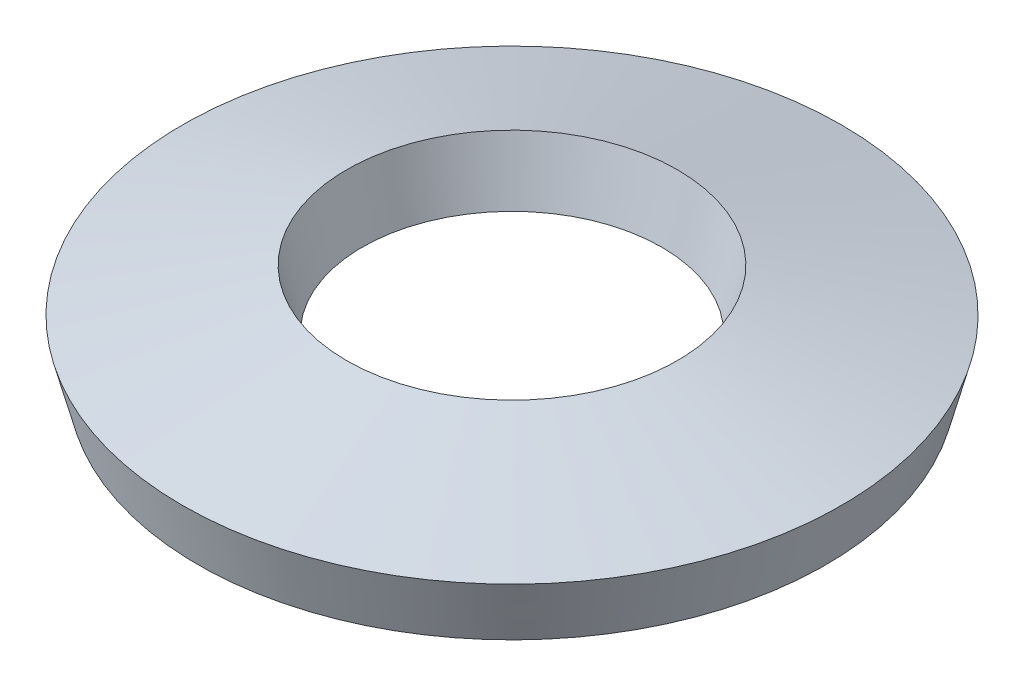
ISO-10303-21;
HEADER;
FILE_DESCRIPTION(('STEP AP214'),'2;1');
FILE_NAME('part.step','',(''),(''),'','','');
FILE_SCHEMA(('AUTOMOTIVE_DESIGN { 1 0 10303 214 1 1 1 1 }'));
ENDSEC;
DATA;
#1=APPLICATION_CONTEXT('core data for automotive mechanical design processes');
#2=APPLICATION_PROTOCOL_DEFINITION('international standard','automotive_design',2000,#1);
#3=PRODUCT_CONTEXT('',#1,'mechanical');
#4=PRODUCT('Part','Part','',(#3));
#5=PRODUCT_RELATED_PRODUCT_CATEGORY('part','',(#4));
#6=PRODUCT_DEFINITION_FORMATION('','',#4);
#7=PRODUCT_DEFINITION_CONTEXT('part definition',#1,'design');
#8=PRODUCT_DEFINITION('design','',#6,#7);
#9=PRODUCT_DEFINITION_SHAPE('','',#8);
#10=(LENGTH_UNIT() NAMED_UNIT(*) SI_UNIT(.MILLI.,.METRE.));
#11=(NAMED_UNIT(*) PLANE_ANGLE_UNIT() SI_UNIT($,.RADIAN.));
#12=(NAMED_UNIT(*) SI_UNIT($,.STERADIAN.) SOLID_ANGLE_UNIT());
#13=UNCERTAINTY_MEASURE_WITH_UNIT(LENGTH_MEASURE(1.E-05),#10,'distance_accuracy_value','');
#14=(GEOMETRIC_REPRESENTATION_CONTEXT(3) GLOBAL_UNCERTAINTY_ASSIGNED_CONTEXT((#13)) GLOBAL_UNIT_ASSIGNED_CONTEXT((#10,
#11,#12)) REPRESENTATION_CONTEXT('',''));
#15=CARTESIAN_POINT('',(0.,0.,0.));
#16=DIRECTION('',(0.,0.,1.));
#17=DIRECTION('',(1.,0.,0.));
#18=AXIS2_PLACEMENT_3D('',#15,#16,#17);
#19=CARTESIAN_POINT('',(0.,0.,0.));
#20=DIRECTION('',(0.,1.,0.));
#21=DIRECTION('',(0.,0.,1.));
#22=AXIS2_PLACEMENT_3D('',#19,#20,#21);
#23=CONICAL_SURFACE('',#22,6.76250709682107,0.257839014382559);
#24=CARTESIAN_POINT('',(0.,1.27713866920093,0.));
#25=DIRECTION('',(0.,-1.,0.));
#26=DIRECTION('',(0.,0.,-1.));
#27=AXIS2_PLACEMENT_3D('',#24,#25,#26);
#28=CIRCLE('',#27,7.0993);
#29=CARTESIAN_POINT('',(0.,1.27713866920093,-7.0993));
#30=VERTEX_POINT('',#29);
#31=EDGE_CURVE('E54',#30,#30,#28,.T.);
#32=ORIENTED_EDGE('',*,*,#31,.T.);
#33=EDGE_LOOP('',(#32));
#34=FACE_BOUND('',#33,.T.);
#35=CARTESIAN_POINT('',(0.,0.,0.));
#36=DIRECTION('',(0.,-1.,0.));
#37=DIRECTION('',(0.,0.,-1.));
#38=AXIS2_PLACEMENT_3D('',#35,#36,#37);
#39=CIRCLE('',#38,6.76250709682107);
#40=CARTESIAN_POINT('',(0.,0.,-6.76250709682107));
#41=VERTEX_POINT('',#40);
#42=EDGE_CURVE('E10',#41,#41,#39,.T.);
#43=ORIENTED_EDGE('',*,*,#42,.F.);
#44=EDGE_LOOP('',(#43));
#45=FACE_BOUND('',#44,.T.);
#46=ADVANCED_FACE('F40',(#34,#45),#23,.T.);
#47=CARTESIAN_POINT('',(0.,0.932661330799073,0.));
#48=DIRECTION('',(0.,-1.,0.));
#49=DIRECTION('',(0.,0.,-1.));
#50=AXIS2_PLACEMENT_3D('',#47,#48,#49);
#51=CONICAL_SURFACE('',#50,3.2258,1.31295731241234);
#52=ORIENTED_EDGE('',*,*,#42,.T.);
#53=EDGE_LOOP('',(#52));
#54=FACE_BOUND('',#53,.T.);
#55=CARTESIAN_POINT('',(0.,0.932661330799073,0.));
#56=DIRECTION('',(0.,-1.,0.));
#57=DIRECTION('',(0.,0.,-1.));
#58=AXIS2_PLACEMENT_3D('',#55,#56,#57);
#59=CIRCLE('',#58,3.2258);
#60=CARTESIAN_POINT('',(0.,0.932661330799073,-3.2258));
#61=VERTEX_POINT('',#60);
#62=EDGE_CURVE('E46',#61,#61,#59,.T.);
#63=ORIENTED_EDGE('',*,*,#62,.F.);
#64=EDGE_LOOP('',(#63));
#65=FACE_BOUND('',#64,.T.);
#66=ADVANCED_FACE('F70',(#54,#65),#51,.F.);
#67=CARTESIAN_POINT('',(0.,2.2098,0.));
#68=DIRECTION('',(0.,1.,0.));
#69=DIRECTION('',(0.,0.,1.));
#70=AXIS2_PLACEMENT_3D('',#67,#68,#69);
#71=CONICAL_SURFACE('',#70,3.56259290317893,0.257839014382559);
#72=ORIENTED_EDGE('',*,*,#62,.T.);
#73=EDGE_LOOP('',(#72));
#74=FACE_BOUND('',#73,.T.);
#75=CARTESIAN_POINT('',(0.,2.2098,0.));
#76=DIRECTION('',(0.,-1.,0.));
#77=DIRECTION('',(0.,0.,-1.));
#78=AXIS2_PLACEMENT_3D('',#75,#76,#77);
#79=CIRCLE('',#78,3.56259290317893);
#80=CARTESIAN_POINT('',(0.,2.2098,-3.56259290317893));
#81=VERTEX_POINT('',#80);
#82=EDGE_CURVE('E50',#81,#81,#79,.T.);
#83=ORIENTED_EDGE('',*,*,#82,.F.);
#84=EDGE_LOOP('',(#83));
#85=FACE_BOUND('',#84,.T.);
#86=ADVANCED_FACE('F64',(#74,#85),#71,.F.);
#87=CARTESIAN_POINT('',(0.,1.27713866920093,0.));
#88=DIRECTION('',(0.,-1.,0.));
#89=DIRECTION('',(0.,0.,-1.));
#90=AXIS2_PLACEMENT_3D('',#87,#88,#89);
#91=CONICAL_SURFACE('',#90,7.0993,1.31295731241234);
#92=ORIENTED_EDGE('',*,*,#82,.T.);
#93=EDGE_LOOP('',(#92));
#94=FACE_BOUND('',#93,.T.);
#95=ORIENTED_EDGE('',*,*,#31,.F.);
#96=EDGE_LOOP('',(#95));
#97=FACE_BOUND('',#96,.T.);
#98=ADVANCED_FACE('F62',(#94,#97),#91,.T.);
#99=CLOSED_SHELL('',(#46,#66,#86,#98));
#100=MANIFOLD_SOLID_BREP('B2',#99);
#101=ADVANCED_BREP_SHAPE_REPRESENTATION('',(#18,#100),#14);
#102=SHAPE_DEFINITION_REPRESENTATION(#9,#101);
ENDSEC;
END-ISO-10303-21;
